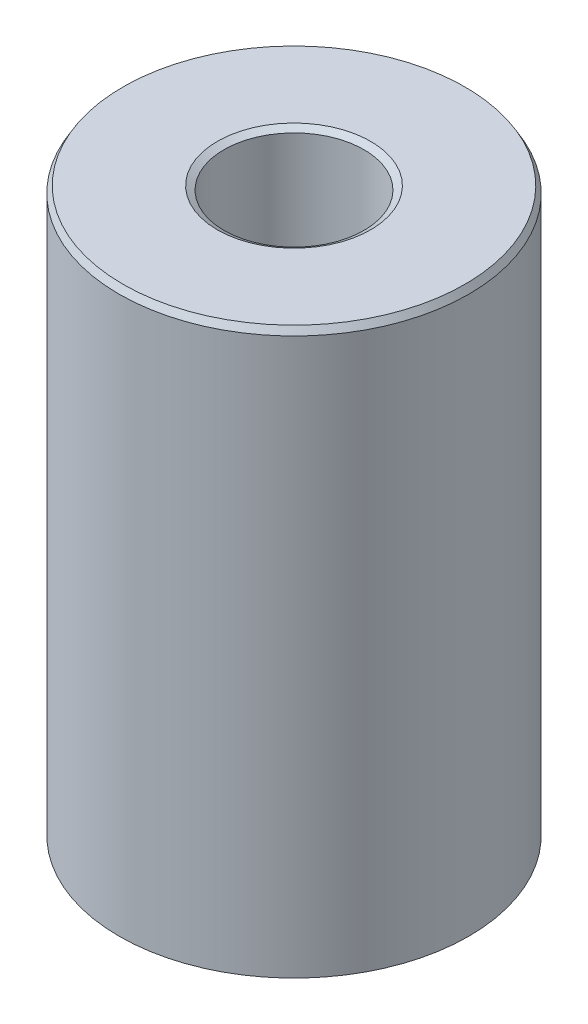
ISO-10303-21;
HEADER;
FILE_DESCRIPTION(('STEP AP214'),'2;1');
FILE_NAME('part.step','',(''),(''),'','','');
FILE_SCHEMA(('AUTOMOTIVE_DESIGN { 1 0 10303 214 1 1 1 1 }'));
ENDSEC;
DATA;
#1=APPLICATION_CONTEXT('core data for automotive mechanical design processes');
#2=APPLICATION_PROTOCOL_DEFINITION('international standard','automotive_design',2000,#1);
#3=PRODUCT_CONTEXT('',#1,'mechanical');
#4=PRODUCT('Part','Part','',(#3));
#5=PRODUCT_RELATED_PRODUCT_CATEGORY('part','',(#4));
#6=PRODUCT_DEFINITION_FORMATION('','',#4);
#7=PRODUCT_DEFINITION_CONTEXT('part definition',#1,'design');
#8=PRODUCT_DEFINITION('design','',#6,#7);
#9=PRODUCT_DEFINITION_SHAPE('','',#8);
#10=(LENGTH_UNIT() NAMED_UNIT(*) SI_UNIT(.MILLI.,.METRE.));
#11=(NAMED_UNIT(*) PLANE_ANGLE_UNIT() SI_UNIT($,.RADIAN.));
#12=(NAMED_UNIT(*) SI_UNIT($,.STERADIAN.) SOLID_ANGLE_UNIT());
#13=UNCERTAINTY_MEASURE_WITH_UNIT(LENGTH_MEASURE(1.E-05),#10,'distance_accuracy_value','');
#14=(GEOMETRIC_REPRESENTATION_CONTEXT(3) GLOBAL_UNCERTAINTY_ASSIGNED_CONTEXT((#13)) GLOBAL_UNIT_ASSIGNED_CONTEXT((#10,
#11,#12)) REPRESENTATION_CONTEXT('',''));
#15=CARTESIAN_POINT('',(0.,0.,0.));
#16=DIRECTION('',(0.,0.,1.));
#17=DIRECTION('',(1.,0.,0.));
#18=AXIS2_PLACEMENT_3D('',#15,#16,#17);
#19=CARTESIAN_POINT('',(0.,24.3065830430425,0.));
#20=DIRECTION('',(0.,-1.,0.));
#21=DIRECTION('',(0.,0.,-1.));
#22=AXIS2_PLACEMENT_3D('',#19,#20,#21);
#23=CYLINDRICAL_SURFACE('',#22,7.5);
#24=CARTESIAN_POINT('',(0.,0.165073561125401,0.));
#25=DIRECTION('',(0.,1.,0.));
#26=DIRECTION('',(0.,0.,1.));
#27=AXIS2_PLACEMENT_3D('',#24,#25,#26);
#28=CIRCLE('',#27,7.5);
#29=CARTESIAN_POINT('',(0.,0.165073561125401,7.5));
#30=VERTEX_POINT('',#29);
#31=EDGE_CURVE('E10',#30,#30,#28,.T.);
#32=ORIENTED_EDGE('',*,*,#31,.T.);
#33=EDGE_LOOP('',(#32));
#34=FACE_BOUND('',#33,.T.);
#35=CARTESIAN_POINT('',(0.,24.020667248187,0.));
#36=DIRECTION('',(0.,1.,0.));
#37=DIRECTION('',(0.,0.,1.));
#38=AXIS2_PLACEMENT_3D('',#35,#36,#37);
#39=CIRCLE('',#38,7.5);
#40=CARTESIAN_POINT('',(0.,24.020667248187,7.5));
#41=VERTEX_POINT('',#40);
#42=EDGE_CURVE('E50',#41,#41,#39,.F.);
#43=ORIENTED_EDGE('',*,*,#42,.T.);
#44=EDGE_LOOP('',(#43));
#45=FACE_BOUND('',#44,.T.);
#46=ADVANCED_FACE('F39',(#34,#45),#23,.T.);
#47=CARTESIAN_POINT('',(0.,24.3065830430425,0.));
#48=DIRECTION('',(0.,1.,0.));
#49=DIRECTION('',(0.,0.,1.));
#50=AXIS2_PLACEMENT_3D('',#47,#48,#49);
#51=PLANE('',#50);
#52=CARTESIAN_POINT('',(0.,24.3065830430425,0.));
#53=DIRECTION('',(0.,1.,0.));
#54=DIRECTION('',(0.,0.,1.));
#55=AXIS2_PLACEMENT_3D('',#52,#53,#54);
#56=CIRCLE('',#55,3.28907655279872);
#57=CARTESIAN_POINT('',(0.,24.3065830430425,3.28907655279872));
#58=VERTEX_POINT('',#57);
#59=EDGE_CURVE('E58',#58,#58,#56,.F.);
#60=ORIENTED_EDGE('',*,*,#59,.T.);
#61=EDGE_LOOP('',(#60));
#62=FACE_BOUND('',#61,.T.);
#63=CARTESIAN_POINT('',(0.,24.3065830430425,0.));
#64=DIRECTION('',(0.,1.,0.));
#65=DIRECTION('',(0.,0.,1.));
#66=AXIS2_PLACEMENT_3D('',#63,#64,#65);
#67=CIRCLE('',#66,7.3349264388746);
#68=CARTESIAN_POINT('',(0.,24.3065830430425,7.3349264388746));
#69=VERTEX_POINT('',#68);
#70=EDGE_CURVE('E61',#69,#69,#67,.T.);
#71=ORIENTED_EDGE('',*,*,#70,.T.);
#72=EDGE_LOOP('',(#71));
#73=FACE_BOUND('',#72,.T.);
#74=ADVANCED_FACE('F88',(#62,#73),#51,.T.);
#75=CARTESIAN_POINT('',(0.,0.,0.));
#76=DIRECTION('',(0.,1.,0.));
#77=DIRECTION('',(0.,0.,1.));
#78=AXIS2_PLACEMENT_3D('',#75,#76,#77);
#79=PLANE('',#78);
#80=CARTESIAN_POINT('',(0.,0.,0.));
#81=DIRECTION('',(0.,1.,0.));
#82=DIRECTION('',(0.,0.,1.));
#83=AXIS2_PLACEMENT_3D('',#80,#81,#82);
#84=CIRCLE('',#83,3.16823431906861);
#85=CARTESIAN_POINT('',(0.,0.,3.16823431906861));
#86=VERTEX_POINT('',#85);
#87=EDGE_CURVE('E51',#86,#86,#84,.T.);
#88=ORIENTED_EDGE('',*,*,#87,.T.);
#89=EDGE_LOOP('',(#88));
#90=FACE_BOUND('',#89,.T.);
#91=CARTESIAN_POINT('',(0.,0.,0.));
#92=DIRECTION('',(0.,1.,0.));
#93=DIRECTION('',(0.,0.,1.));
#94=AXIS2_PLACEMENT_3D('',#91,#92,#93);
#95=CIRCLE('',#94,7.21408420514447);
#96=CARTESIAN_POINT('',(0.,0.,7.21408420514447));
#97=VERTEX_POINT('',#96);
#98=EDGE_CURVE('E54',#97,#97,#95,.F.);
#99=ORIENTED_EDGE('',*,*,#98,.T.);
#100=EDGE_LOOP('',(#99));
#101=FACE_BOUND('',#100,.T.);
#102=ADVANCED_FACE('F83',(#90,#101),#79,.F.);
#103=CARTESIAN_POINT('',(0.,24.3065830430425,0.));
#104=DIRECTION('',(0.,-1.,0.));
#105=DIRECTION('',(0.,0.,-1.));
#106=AXIS2_PLACEMENT_3D('',#103,#104,#105);
#107=CYLINDRICAL_SURFACE('',#106,3.0031607579432);
#108=CARTESIAN_POINT('',(0.,24.1415094819171,0.));
#109=DIRECTION('',(0.,1.,0.));
#110=DIRECTION('',(0.,0.,1.));
#111=AXIS2_PLACEMENT_3D('',#108,#109,#110);
#112=CIRCLE('',#111,3.0031607579432);
#113=CARTESIAN_POINT('',(0.,24.1415094819171,3.0031607579432));
#114=VERTEX_POINT('',#113);
#115=EDGE_CURVE('E67',#114,#114,#112,.T.);
#116=ORIENTED_EDGE('',*,*,#115,.T.);
#117=EDGE_LOOP('',(#116));
#118=FACE_BOUND('',#117,.T.);
#119=CARTESIAN_POINT('',(0.,0.285915794855526,0.));
#120=DIRECTION('',(0.,1.,0.));
#121=DIRECTION('',(0.,0.,1.));
#122=AXIS2_PLACEMENT_3D('',#119,#120,#121);
#123=CIRCLE('',#122,3.0031607579432);
#124=CARTESIAN_POINT('',(0.,0.285915794855526,3.0031607579432));
#125=VERTEX_POINT('',#124);
#126=EDGE_CURVE('E69',#125,#125,#123,.F.);
#127=ORIENTED_EDGE('',*,*,#126,.T.);
#128=EDGE_LOOP('',(#127));
#129=FACE_BOUND('',#128,.T.);
#130=ADVANCED_FACE('F71',(#118,#129),#107,.F.);
#131=CARTESIAN_POINT('',(0.,24.1415094819171,0.));
#132=DIRECTION('',(0.,1.,0.));
#133=DIRECTION('',(0.,0.,1.));
#134=AXIS2_PLACEMENT_3D('',#131,#132,#133);
#135=CONICAL_SURFACE('',#134,3.0031607579432,1.0471975511966);
#136=ORIENTED_EDGE('',*,*,#59,.F.);
#137=EDGE_LOOP('',(#136));
#138=FACE_BOUND('',#137,.T.);
#139=ORIENTED_EDGE('',*,*,#115,.F.);
#140=EDGE_LOOP('',(#139));
#141=FACE_BOUND('',#140,.T.);
#142=ADVANCED_FACE('F77',(#138,#141),#135,.F.);
#143=CARTESIAN_POINT('',(0.,0.,0.));
#144=DIRECTION('',(0.,-1.,0.));
#145=DIRECTION('',(0.,0.,-1.));
#146=AXIS2_PLACEMENT_3D('',#143,#144,#145);
#147=CONICAL_SURFACE('',#146,3.16823431906861,0.523598775598294);
#148=ORIENTED_EDGE('',*,*,#126,.F.);
#149=EDGE_LOOP('',(#148));
#150=FACE_BOUND('',#149,.T.);
#151=ORIENTED_EDGE('',*,*,#87,.F.);
#152=EDGE_LOOP('',(#151));
#153=FACE_BOUND('',#152,.T.);
#154=ADVANCED_FACE('F73',(#150,#153),#147,.F.);
#155=CARTESIAN_POINT('',(0.,0.165073561125401,0.));
#156=DIRECTION('',(0.,1.,0.));
#157=DIRECTION('',(0.,0.,1.));
#158=AXIS2_PLACEMENT_3D('',#155,#156,#157);
#159=CONICAL_SURFACE('',#158,7.5,1.0471975511966);
#160=ORIENTED_EDGE('',*,*,#98,.F.);
#161=EDGE_LOOP('',(#160));
#162=FACE_BOUND('',#161,.T.);
#163=ORIENTED_EDGE('',*,*,#31,.F.);
#164=EDGE_LOOP('',(#163));
#165=FACE_BOUND('',#164,.T.);
#166=ADVANCED_FACE('F76',(#162,#165),#159,.T.);
#167=CARTESIAN_POINT('',(0.,24.3065830430425,0.));
#168=DIRECTION('',(0.,-1.,0.));
#169=DIRECTION('',(0.,0.,-1.));
#170=AXIS2_PLACEMENT_3D('',#167,#168,#169);
#171=CONICAL_SURFACE('',#170,7.3349264388746,0.523598775598304);
#172=ORIENTED_EDGE('',*,*,#42,.F.);
#173=EDGE_LOOP('',(#172));
#174=FACE_BOUND('',#173,.T.);
#175=ORIENTED_EDGE('',*,*,#70,.F.);
#176=EDGE_LOOP('',(#175));
#177=FACE_BOUND('',#176,.T.);
#178=ADVANCED_FACE('F45',(#174,#177),#171,.T.);
#179=CLOSED_SHELL('',(#46,#74,#102,#130,#142,#154,#166,#178));
#180=MANIFOLD_SOLID_BREP('B2',#179);
#181=ADVANCED_BREP_SHAPE_REPRESENTATION('',(#18,#180),#14);
#182=SHAPE_DEFINITION_REPRESENTATION(#9,#181);
ENDSEC;
END-ISO-10303-21;
